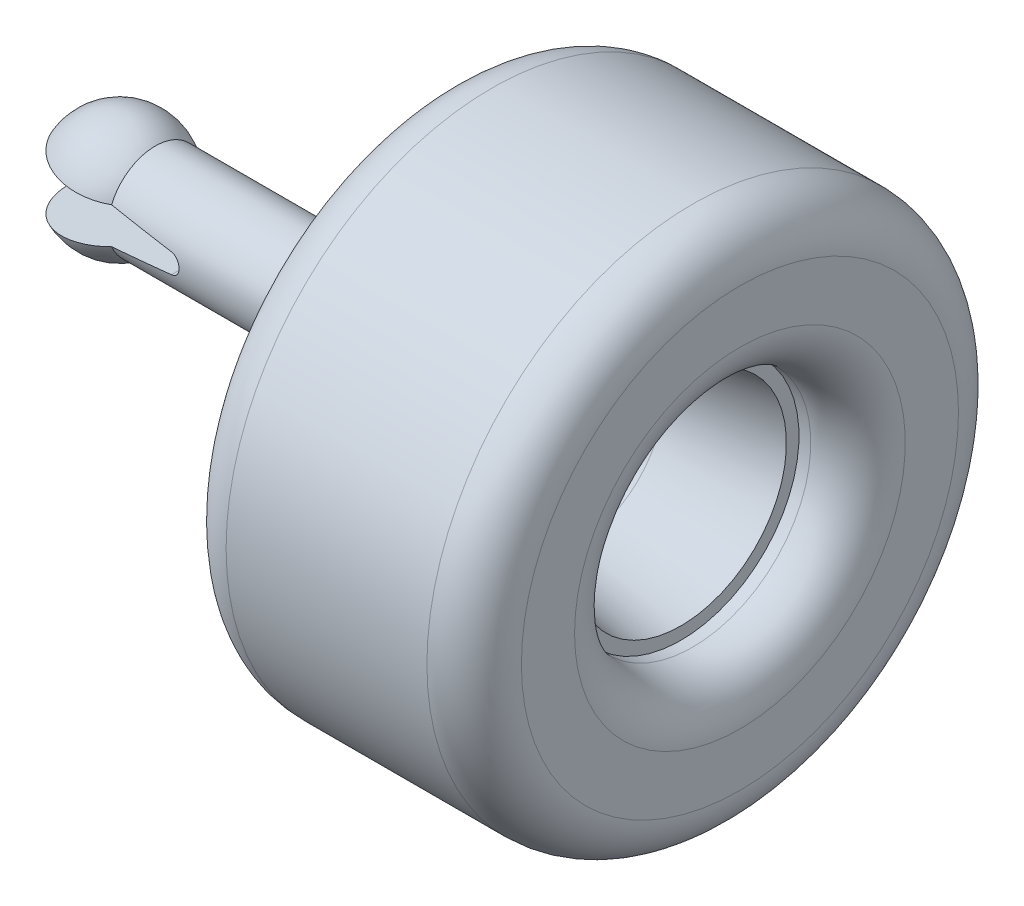
ISO-10303-21;
HEADER;
FILE_DESCRIPTION(('STEP AP214'),'2;1');
FILE_NAME('part.step','',(''),(''),'','','');
FILE_SCHEMA(('AUTOMOTIVE_DESIGN { 1 0 10303 214 1 1 1 1 }'));
ENDSEC;
DATA;
#1=APPLICATION_CONTEXT('core data for automotive mechanical design processes');
#2=APPLICATION_PROTOCOL_DEFINITION('international standard','automotive_design',2000,#1);
#3=PRODUCT_CONTEXT('',#1,'mechanical');
#4=PRODUCT('Part','Part','',(#3));
#5=PRODUCT_RELATED_PRODUCT_CATEGORY('part','',(#4));
#6=PRODUCT_DEFINITION_FORMATION('','',#4);
#7=PRODUCT_DEFINITION_CONTEXT('part definition',#1,'design');
#8=PRODUCT_DEFINITION('design','',#6,#7);
#9=PRODUCT_DEFINITION_SHAPE('','',#8);
#10=(LENGTH_UNIT() NAMED_UNIT(*) SI_UNIT(.MILLI.,.METRE.));
#11=(NAMED_UNIT(*) PLANE_ANGLE_UNIT() SI_UNIT($,.RADIAN.));
#12=(NAMED_UNIT(*) SI_UNIT($,.STERADIAN.) SOLID_ANGLE_UNIT());
#13=UNCERTAINTY_MEASURE_WITH_UNIT(LENGTH_MEASURE(1.E-05),#10,'distance_accuracy_value','');
#14=(GEOMETRIC_REPRESENTATION_CONTEXT(3) GLOBAL_UNCERTAINTY_ASSIGNED_CONTEXT((#13)) GLOBAL_UNIT_ASSIGNED_CONTEXT((#10,
#11,#12)) REPRESENTATION_CONTEXT('',''));
#15=CARTESIAN_POINT('',(0.,0.,0.));
#16=DIRECTION('',(0.,0.,1.));
#17=DIRECTION('',(1.,0.,0.));
#18=AXIS2_PLACEMENT_3D('',#15,#16,#17);
#19=CARTESIAN_POINT('',(0.,0.,0.));
#20=DIRECTION('',(-1.,0.,0.));
#21=DIRECTION('',(0.,1.,0.));
#22=AXIS2_PLACEMENT_3D('',#19,#20,#21);
#23=SPHERICAL_SURFACE('',#22,10.);
#24=CARTESIAN_POINT('',(0.499502112523149,3.7940952255126,0.));
#25=DIRECTION('',(-0.130526192220052,-0.99144486137381,0.));
#26=DIRECTION('',(0.99144486137381,-0.130526192220052,0.));
#27=AXIS2_PLACEMENT_3D('',#24,#25,#26);
#28=CIRCLE('',#27,9.23879532511287);
#29=CARTESIAN_POINT('',(6.,3.06994094065208,7.38752073573457));
#30=VERTEX_POINT('',#29);
#31=CARTESIAN_POINT('',(6.,3.06994094065208,-7.38752073573457));
#32=VERTEX_POINT('',#31);
#33=EDGE_CURVE('E82',#30,#32,#28,.T.);
#34=ORIENTED_EDGE('',*,*,#33,.F.);
#35=CARTESIAN_POINT('',(6.,0.,0.));
#36=DIRECTION('',(-1.,0.,0.));
#37=DIRECTION('',(0.,0.,1.));
#38=AXIS2_PLACEMENT_3D('',#35,#36,#37);
#39=CIRCLE('',#38,8.);
#40=EDGE_CURVE('E89',#30,#32,#39,.T.);
#41=ORIENTED_EDGE('',*,*,#40,.T.);
#42=EDGE_LOOP('',(#34,#41));
#43=FACE_BOUND('',#42,.T.);
#44=ADVANCED_FACE('F33',(#43),#23,.T.);
#45=CARTESIAN_POINT('',(0.499502112523149,-3.7940952255126,0.));
#46=DIRECTION('',(-0.130526192220052,0.99144486137381,0.));
#47=DIRECTION('',(-0.99144486137381,-0.130526192220052,0.));
#48=AXIS2_PLACEMENT_3D('',#45,#46,#47);
#49=CIRCLE('',#48,9.23879532511287);
#50=CARTESIAN_POINT('',(6.,-3.06994094065208,-7.38752073573457));
#51=VERTEX_POINT('',#50);
#52=CARTESIAN_POINT('',(6.,-3.06994094065208,7.38752073573457));
#53=VERTEX_POINT('',#52);
#54=EDGE_CURVE('E76',#51,#53,#49,.T.);
#55=ORIENTED_EDGE('',*,*,#54,.F.);
#56=EDGE_CURVE('E79',#51,#53,#39,.T.);
#57=ORIENTED_EDGE('',*,*,#56,.T.);
#58=EDGE_LOOP('',(#55,#57));
#59=FACE_BOUND('',#58,.T.);
#60=ADVANCED_FACE('F78',(#59),#23,.T.);
#61=CARTESIAN_POINT('',(0.,0.,0.));
#62=DIRECTION('',(-1.,0.,0.));
#63=DIRECTION('',(0.,0.,1.));
#64=AXIS2_PLACEMENT_3D('',#61,#62,#63);
#65=CYLINDRICAL_SURFACE('',#64,8.);
#66=CARTESIAN_POINT('',(49.,0.,0.));
#67=DIRECTION('',(-1.,0.,0.));
#68=DIRECTION('',(0.,0.,1.));
#69=AXIS2_PLACEMENT_3D('',#66,#67,#68);
#70=CIRCLE('',#69,8.);
#71=CARTESIAN_POINT('',(49.,0.,8.));
#72=VERTEX_POINT('',#71);
#73=EDGE_CURVE('E135',#72,#72,#70,.T.);
#74=ORIENTED_EDGE('',*,*,#73,.T.);
#75=EDGE_LOOP('',(#74));
#76=FACE_BOUND('',#75,.T.);
#77=CARTESIAN_POINT('',(29.3185165257813,0.,0.));
#78=DIRECTION('',(-0.130526192220052,-0.99144486137381,0.));
#79=DIRECTION('',(-0.99144486137381,0.130526192220052,0.));
#80=AXIS2_PLACEMENT_3D('',#77,#78,#79);
#81=ELLIPSE('',#80,61.290380604323,8.);
#82=CARTESIAN_POINT('',(16.5608664035253,1.67957650194115,7.8217020381837));
#83=VERTEX_POINT('',#82);
#84=EDGE_CURVE('E11',#83,#30,#81,.T.);
#85=ORIENTED_EDGE('',*,*,#84,.F.);
#86=CARTESIAN_POINT('',(16.5608664035253,-1.67957650194115,7.8217020381837));
#87=CARTESIAN_POINT('',(16.6078772170164,-1.67338762543842,7.82302855108955));
#88=CARTESIAN_POINT('',(16.6545923422185,-1.66522811009731,7.82477563599176));
#89=CARTESIAN_POINT('',(16.7471345142977,-1.64503813357798,7.82904617848296));
#90=CARTESIAN_POINT('',(16.7929617051527,-1.63300830563297,7.83156950906515));
#91=CARTESIAN_POINT('',(16.9284754014379,-1.59128070855494,7.84019399394773));
#92=CARTESIAN_POINT('',(17.0164191339467,-1.55591485482529,7.84735653429988));
#93=CARTESIAN_POINT('',(17.1849951770382,-1.47116924530017,7.86368295557066));
#94=CARTESIAN_POINT('',(17.2656278955788,-1.42179027207888,7.87284672472243));
#95=CARTESIAN_POINT('',(17.4175239261706,-1.31039436960253,7.89215143834716));
#96=CARTESIAN_POINT('',(17.4887859512125,-1.24837570733741,7.90229251671701));
#97=CARTESIAN_POINT('',(17.6209427467648,-1.11243703765622,7.92257916606893));
#98=CARTESIAN_POINT('',(17.6816821500275,-1.03836565464713,7.93272289609297));
#99=CARTESIAN_POINT('',(17.7898990682916,-0.880937155240475,7.9517436269811));
#100=CARTESIAN_POINT('',(17.8373756879766,-0.797579412489655,7.96062054230794));
#101=CARTESIAN_POINT('',(17.9176296745451,-0.623934920890098,7.9761073846185));
#102=CARTESIAN_POINT('',(17.9504178222908,-0.533653311126496,7.98271897343746));
#103=CARTESIAN_POINT('',(18.0003036625157,-0.348697563255279,7.9929330301457));
#104=CARTESIAN_POINT('',(18.0174041378688,-0.254024207341631,7.99653603172528));
#105=CARTESIAN_POINT('',(18.0351812898347,-0.0649264046473598,8.00028471028731));
#106=CARTESIAN_POINT('',(18.0361681921212,0.0294676640748496,8.00049569074478));
#107=CARTESIAN_POINT('',(18.0224820490252,0.217058139199833,7.99760497865984));
#108=CARTESIAN_POINT('',(18.0078096358643,0.31025459380076,7.99450341985627));
#109=CARTESIAN_POINT('',(17.9634572208263,0.49205720501012,7.98536817502689));
#110=CARTESIAN_POINT('',(17.9338973614567,0.580693944827233,7.97935797682421));
#111=CARTESIAN_POINT('',(17.8607254169284,0.75176455890913,7.96506281352426));
#112=CARTESIAN_POINT('',(17.8171121127074,0.83419789429573,7.95677765109503));
#113=CARTESIAN_POINT('',(17.7163043503394,0.991891543038238,7.93867449799588));
#114=CARTESIAN_POINT('',(17.6589139074844,1.06702407507846,7.92883516146981));
#115=CARTESIAN_POINT('',(17.5324746052698,1.20670885364806,7.90878266995101));
#116=CARTESIAN_POINT('',(17.4634230384255,1.27125863619489,7.8985694285772));
#117=CARTESIAN_POINT('',(17.3143007976698,1.38898781207942,7.87872723601544));
#118=CARTESIAN_POINT('',(17.2340698925972,1.44196630448345,7.86911041438953));
#119=CARTESIAN_POINT('',(17.0656806435511,1.5336425345316,7.85175953658975));
#120=CARTESIAN_POINT('',(16.9775295819394,1.57235322722257,7.84402377461176));
#121=CARTESIAN_POINT('',(16.8338504437119,1.62137648926141,7.83399484923287));
#122=CARTESIAN_POINT('',(16.7800760782905,1.63679694146785,7.83077800436232));
#123=CARTESIAN_POINT('',(16.6712916163422,1.66224742004713,7.82541266745395));
#124=CARTESIAN_POINT('',(16.6162832801273,1.67228467242321,7.82326274355275));
#125=CARTESIAN_POINT('',(16.5608664035253,1.67957650194115,7.8217020381837));
#126=B_SPLINE_CURVE_WITH_KNOTS('',3,(#86,#87,#88,#89,#90,#91,#92,#93,#94,#95,#96,#97,#98,#99,
#100,#101,#102,#103,#104,#105,#106,#107,#108,#109,#110,#111,#112,#113,#114,#115,#116,#117,#118,
#119,#120,#121,#122,#123,#124,#125),.UNSPECIFIED.,.F.,.F.,(4,2,2,2,2,2,2,2,2,2,2,2,2,2,2,2,2,2,
2,4),(0.,0.142214203486567,0.284405150711697,0.568114307916015,0.851807624266233,
1.13553986360921,1.42315832931077,1.71079620627369,1.9982226190729,2.28559803474745,
2.56743410302325,2.84925879301757,3.12884473630301,3.40845493872973,3.69230672036942,
3.97622449767661,4.26473668466631,4.55298625576828,4.72083168810947,4.88845124984131),.UNSPECIFIED.);
#127=CARTESIAN_POINT('',(16.5608664035253,-1.67957650194115,7.82170203818378));
#128=VERTEX_POINT('',#127);
#129=EDGE_CURVE('E36',#128,#83,#126,.T.);
#130=ORIENTED_EDGE('',*,*,#129,.F.);
#131=CARTESIAN_POINT('',(29.3185165257813,0.,0.));
#132=DIRECTION('',(-0.130526192220052,0.99144486137381,0.));
#133=DIRECTION('',(-0.99144486137381,-0.130526192220052,0.));
#134=AXIS2_PLACEMENT_3D('',#131,#132,#133);
#135=ELLIPSE('',#134,61.290380604323,8.);
#136=EDGE_CURVE('E88',#53,#128,#135,.T.);
#137=ORIENTED_EDGE('',*,*,#136,.F.);
#138=ORIENTED_EDGE('',*,*,#56,.F.);
#139=CARTESIAN_POINT('',(16.5608664035253,-1.67957650194115,-7.82170203818364));
#140=VERTEX_POINT('',#139);
#141=EDGE_CURVE('E86',#140,#51,#135,.T.);
#142=ORIENTED_EDGE('',*,*,#141,.F.);
#143=CARTESIAN_POINT('',(16.5608664035253,1.67957650194115,-7.8217020381837));
#144=CARTESIAN_POINT('',(16.6078772170164,1.67338762543842,-7.82302855108955));
#145=CARTESIAN_POINT('',(16.6545923422185,1.66522811009731,-7.82477563599176));
#146=CARTESIAN_POINT('',(16.7471345142977,1.64503813357798,-7.82904617848296));
#147=CARTESIAN_POINT('',(16.7929617051527,1.63300830563297,-7.83156950906515));
#148=CARTESIAN_POINT('',(16.9284754014379,1.59128070855494,-7.84019399394773));
#149=CARTESIAN_POINT('',(17.0164191339467,1.55591485482529,-7.84735653429988));
#150=CARTESIAN_POINT('',(17.1849951770382,1.47116924530017,-7.86368295557066));
#151=CARTESIAN_POINT('',(17.2656278955788,1.42179027207888,-7.87284672472243));
#152=CARTESIAN_POINT('',(17.4175239261706,1.31039436960253,-7.89215143834716));
#153=CARTESIAN_POINT('',(17.4887859512125,1.24837570733741,-7.90229251671701));
#154=CARTESIAN_POINT('',(17.6209427467648,1.11243703765622,-7.92257916606893));
#155=CARTESIAN_POINT('',(17.6816821500275,1.03836565464713,-7.93272289609297));
#156=CARTESIAN_POINT('',(17.7898990682916,0.880937155240475,-7.9517436269811));
#157=CARTESIAN_POINT('',(17.8373756879766,0.797579412489655,-7.96062054230794));
#158=CARTESIAN_POINT('',(17.9176296745451,0.623934920890098,-7.9761073846185));
#159=CARTESIAN_POINT('',(17.9504178222908,0.533653311126496,-7.98271897343746));
#160=CARTESIAN_POINT('',(18.0003036625157,0.348697563255279,-7.9929330301457));
#161=CARTESIAN_POINT('',(18.0174041378688,0.254024207341631,-7.99653603172528));
#162=CARTESIAN_POINT('',(18.0351812898347,0.0649264046473598,-8.00028471028731));
#163=CARTESIAN_POINT('',(18.0361681921212,-0.0294676640748496,-8.00049569074478));
#164=CARTESIAN_POINT('',(18.0224820490252,-0.217058139199833,-7.99760497865984));
#165=CARTESIAN_POINT('',(18.0078096358643,-0.31025459380076,-7.99450341985627));
#166=CARTESIAN_POINT('',(17.9634572208263,-0.49205720501012,-7.98536817502689));
#167=CARTESIAN_POINT('',(17.9338973614567,-0.580693944827233,-7.97935797682421));
#168=CARTESIAN_POINT('',(17.8607254169284,-0.75176455890913,-7.96506281352426));
#169=CARTESIAN_POINT('',(17.8171121127074,-0.83419789429573,-7.95677765109503));
#170=CARTESIAN_POINT('',(17.7163043503394,-0.991891543038238,-7.93867449799588));
#171=CARTESIAN_POINT('',(17.6589139074844,-1.06702407507846,-7.92883516146981));
#172=CARTESIAN_POINT('',(17.5324746052698,-1.20670885364806,-7.90878266995101));
#173=CARTESIAN_POINT('',(17.4634230384255,-1.27125863619489,-7.8985694285772));
#174=CARTESIAN_POINT('',(17.3143007976698,-1.38898781207942,-7.87872723601544));
#175=CARTESIAN_POINT('',(17.2340698925972,-1.44196630448345,-7.86911041438953));
#176=CARTESIAN_POINT('',(17.0656806435511,-1.5336425345316,-7.85175953658975));
#177=CARTESIAN_POINT('',(16.9775295819394,-1.57235322722257,-7.84402377461176));
#178=CARTESIAN_POINT('',(16.8338504437119,-1.62137648926141,-7.83399484923287));
#179=CARTESIAN_POINT('',(16.7800760782905,-1.63679694146785,-7.83077800436232));
#180=CARTESIAN_POINT('',(16.6712916163422,-1.66224742004713,-7.82541266745395));
#181=CARTESIAN_POINT('',(16.6162832801273,-1.67228467242321,-7.82326274355275));
#182=CARTESIAN_POINT('',(16.5608664035253,-1.67957650194115,-7.8217020381837));
#183=B_SPLINE_CURVE_WITH_KNOTS('',3,(#143,#144,#145,#146,#147,#148,#149,#150,#151,#152,#153,
#154,#155,#156,#157,#158,#159,#160,#161,#162,#163,#164,#165,#166,#167,#168,#169,#170,#171,#172,
#173,#174,#175,#176,#177,#178,#179,#180,#181,#182),.UNSPECIFIED.,.F.,.F.,(4,2,2,2,2,2,2,2,2,2,2,
2,2,2,2,2,2,2,2,4),(0.,0.142214203486567,0.284405150711697,0.568114307916015,0.851807624266233,
1.13553986360921,1.42315832931077,1.71079620627369,1.9982226190729,2.28559803474745,
2.56743410302325,2.84925879301757,3.12884473630301,3.40845493872973,3.69230672036942,
3.97622449767661,4.26473668466631,4.55298625576828,4.72083168810947,4.88845124984131),.UNSPECIFIED.);
#184=CARTESIAN_POINT('',(16.5608664035253,1.67957650194115,-7.8217020381837));
#185=VERTEX_POINT('',#184);
#186=EDGE_CURVE('E95',#185,#140,#183,.T.);
#187=ORIENTED_EDGE('',*,*,#186,.F.);
#188=EDGE_CURVE('E47',#32,#185,#81,.T.);
#189=ORIENTED_EDGE('',*,*,#188,.F.);
#190=ORIENTED_EDGE('',*,*,#40,.F.);
#191=EDGE_LOOP('',(#85,#130,#137,#138,#142,#187,#189,#190));
#192=FACE_BOUND('',#191,.T.);
#193=ADVANCED_FACE('F85',(#76,#192),#65,.T.);
#194=CARTESIAN_POINT('',(75.,5.,0.));
#195=DIRECTION('',(-1.,0.,0.));
#196=DIRECTION('',(0.,0.,1.));
#197=AXIS2_PLACEMENT_3D('',#194,#195,#196);
#198=PLANE('',#197);
#199=CARTESIAN_POINT('',(75.,0.,0.));
#200=DIRECTION('',(-1.,0.,0.));
#201=DIRECTION('',(0.,0.,1.));
#202=AXIS2_PLACEMENT_3D('',#199,#200,#201);
#203=CIRCLE('',#202,5.);
#204=CARTESIAN_POINT('',(75.,0.,5.));
#205=VERTEX_POINT('',#204);
#206=EDGE_CURVE('E96',#205,#205,#203,.T.);
#207=ORIENTED_EDGE('',*,*,#206,.F.);
#208=EDGE_LOOP('',(#207));
#209=FACE_BOUND('',#208,.T.);
#210=ADVANCED_FACE('F179',(#209),#198,.F.);
#211=CARTESIAN_POINT('',(75.,0.,0.));
#212=DIRECTION('',(-1.,0.,0.));
#213=DIRECTION('',(0.,0.,1.));
#214=AXIS2_PLACEMENT_3D('',#211,#212,#213);
#215=CONICAL_SURFACE('',#214,5.,0.0872664625997168);
#216=CARTESIAN_POINT('',(66.1557394314195,0.,0.));
#217=DIRECTION('',(-1.,0.,0.));
#218=DIRECTION('',(0.,0.,1.));
#219=AXIS2_PLACEMENT_3D('',#216,#217,#218);
#220=CIRCLE('',#219,5.77377253702014);
#221=CARTESIAN_POINT('',(66.1557394314195,0.,5.77377253702014));
#222=VERTEX_POINT('',#221);
#223=EDGE_CURVE('E100',#222,#222,#220,.T.);
#224=ORIENTED_EDGE('',*,*,#223,.F.);
#225=EDGE_LOOP('',(#224));
#226=FACE_BOUND('',#225,.T.);
#227=ORIENTED_EDGE('',*,*,#206,.T.);
#228=EDGE_LOOP('',(#227));
#229=FACE_BOUND('',#228,.T.);
#230=ADVANCED_FACE('F176',(#226,#229),#215,.T.);
#231=CARTESIAN_POINT('',(80.,0.,0.));
#232=DIRECTION('',(-1.,0.,0.));
#233=DIRECTION('',(0.,1.,0.));
#234=AXIS2_PLACEMENT_3D('',#231,#232,#233);
#235=SPHERICAL_SURFACE('',#234,15.);
#236=CARTESIAN_POINT('',(77.395277334996,0.,0.));
#237=DIRECTION('',(-1.,0.,0.));
#238=DIRECTION('',(0.,0.,1.));
#239=AXIS2_PLACEMENT_3D('',#236,#237,#238);
#240=CIRCLE('',#239,14.7721162951831);
#241=CARTESIAN_POINT('',(77.395277334996,0.,14.7721162951831));
#242=VERTEX_POINT('',#241);
#243=EDGE_CURVE('E168',#242,#242,#240,.T.);
#244=ORIENTED_EDGE('',*,*,#243,.F.);
#245=EDGE_LOOP('',(#244));
#246=FACE_BOUND('',#245,.T.);
#247=ORIENTED_EDGE('',*,*,#223,.T.);
#248=EDGE_LOOP('',(#247));
#249=FACE_BOUND('',#248,.T.);
#250=ADVANCED_FACE('F174',(#246,#249),#235,.F.);
#251=CARTESIAN_POINT('',(77.395277334996,0.,0.));
#252=DIRECTION('',(1.,0.,0.));
#253=DIRECTION('',(0.,0.,-1.));
#254=AXIS2_PLACEMENT_3D('',#251,#252,#253);
#255=CONICAL_SURFACE('',#254,14.7721162951831,0.174532925199434);
#256=CARTESIAN_POINT('',(95.,0.,0.));
#257=DIRECTION('',(-1.,0.,0.));
#258=DIRECTION('',(0.,0.,1.));
#259=AXIS2_PLACEMENT_3D('',#256,#257,#258);
#260=CIRCLE('',#259,17.8763038889132);
#261=CARTESIAN_POINT('',(95.,0.,17.8763038889132));
#262=VERTEX_POINT('',#261);
#263=EDGE_CURVE('E165',#262,#262,#260,.T.);
#264=ORIENTED_EDGE('',*,*,#263,.F.);
#265=EDGE_LOOP('',(#264));
#266=FACE_BOUND('',#265,.T.);
#267=ORIENTED_EDGE('',*,*,#243,.T.);
#268=EDGE_LOOP('',(#267));
#269=FACE_BOUND('',#268,.T.);
#270=ADVANCED_FACE('F191',(#266,#269),#255,.F.);
#271=CARTESIAN_POINT('',(95.,20.,0.));
#272=DIRECTION('',(-1.,0.,0.));
#273=DIRECTION('',(0.,0.,1.));
#274=AXIS2_PLACEMENT_3D('',#271,#272,#273);
#275=PLANE('',#274);
#276=CARTESIAN_POINT('',(95.,0.,0.));
#277=DIRECTION('',(-1.,0.,0.));
#278=DIRECTION('',(0.,0.,1.));
#279=AXIS2_PLACEMENT_3D('',#276,#277,#278);
#280=CIRCLE('',#279,20.);
#281=CARTESIAN_POINT('',(95.,0.,20.));
#282=VERTEX_POINT('',#281);
#283=EDGE_CURVE('E162',#282,#282,#280,.T.);
#284=ORIENTED_EDGE('',*,*,#283,.F.);
#285=EDGE_LOOP('',(#284));
#286=FACE_BOUND('',#285,.T.);
#287=ORIENTED_EDGE('',*,*,#263,.T.);
#288=EDGE_LOOP('',(#287));
#289=FACE_BOUND('',#288,.T.);
#290=ADVANCED_FACE('F195',(#286,#289),#275,.F.);
#291=CARTESIAN_POINT('',(0.,0.,0.));
#292=DIRECTION('',(-1.,0.,0.));
#293=DIRECTION('',(0.,0.,1.));
#294=AXIS2_PLACEMENT_3D('',#291,#292,#293);
#295=CYLINDRICAL_SURFACE('',#294,20.);
#296=CARTESIAN_POINT('',(97.,0.,0.));
#297=DIRECTION('',(-1.,0.,0.));
#298=DIRECTION('',(0.,0.,1.));
#299=AXIS2_PLACEMENT_3D('',#296,#297,#298);
#300=CIRCLE('',#299,20.);
#301=CARTESIAN_POINT('',(97.,0.,20.));
#302=VERTEX_POINT('',#301);
#303=EDGE_CURVE('E159',#302,#302,#300,.T.);
#304=ORIENTED_EDGE('',*,*,#303,.F.);
#305=EDGE_LOOP('',(#304));
#306=FACE_BOUND('',#305,.T.);
#307=ORIENTED_EDGE('',*,*,#283,.T.);
#308=EDGE_LOOP('',(#307));
#309=FACE_BOUND('',#308,.T.);
#310=ADVANCED_FACE('F199',(#306,#309),#295,.F.);
#311=CARTESIAN_POINT('',(97.,0.,0.));
#312=DIRECTION('',(-1.,0.,0.));
#313=DIRECTION('',(0.,0.,1.));
#314=AXIS2_PLACEMENT_3D('',#311,#312,#313);
#315=TOROIDAL_SURFACE('',#314,28.,7.99999999999999);
#316=CARTESIAN_POINT('',(105.,0.,0.));
#317=DIRECTION('',(-1.,0.,0.));
#318=DIRECTION('',(0.,0.,1.));
#319=AXIS2_PLACEMENT_3D('',#316,#317,#318);
#320=CIRCLE('',#319,28.);
#321=CARTESIAN_POINT('',(105.,0.,28.));
#322=VERTEX_POINT('',#321);
#323=EDGE_CURVE('E156',#322,#322,#320,.T.);
#324=ORIENTED_EDGE('',*,*,#323,.F.);
#325=EDGE_LOOP('',(#324));
#326=FACE_BOUND('',#325,.T.);
#327=ORIENTED_EDGE('',*,*,#303,.T.);
#328=EDGE_LOOP('',(#327));
#329=FACE_BOUND('',#328,.T.);
#330=ADVANCED_FACE('F203',(#326,#329),#315,.T.);
#331=CARTESIAN_POINT('',(105.,37.,0.));
#332=DIRECTION('',(-1.,0.,0.));
#333=DIRECTION('',(0.,0.,1.));
#334=AXIS2_PLACEMENT_3D('',#331,#332,#333);
#335=PLANE('',#334);
#336=CARTESIAN_POINT('',(105.,0.,0.));
#337=DIRECTION('',(-1.,0.,0.));
#338=DIRECTION('',(0.,0.,1.));
#339=AXIS2_PLACEMENT_3D('',#336,#337,#338);
#340=CIRCLE('',#339,37.);
#341=CARTESIAN_POINT('',(105.,0.,37.));
#342=VERTEX_POINT('',#341);
#343=EDGE_CURVE('E153',#342,#342,#340,.T.);
#344=ORIENTED_EDGE('',*,*,#343,.F.);
#345=EDGE_LOOP('',(#344));
#346=FACE_BOUND('',#345,.T.);
#347=ORIENTED_EDGE('',*,*,#323,.T.);
#348=EDGE_LOOP('',(#347));
#349=FACE_BOUND('',#348,.T.);
#350=ADVANCED_FACE('F207',(#346,#349),#335,.F.);
#351=CARTESIAN_POINT('',(97.,0.,0.));
#352=DIRECTION('',(-1.,0.,0.));
#353=DIRECTION('',(0.,0.,1.));
#354=AXIS2_PLACEMENT_3D('',#351,#352,#353);
#355=TOROIDAL_SURFACE('',#354,37.,7.99999999999999);
#356=CARTESIAN_POINT('',(97.,0.,0.));
#357=DIRECTION('',(-1.,0.,0.));
#358=DIRECTION('',(0.,0.,1.));
#359=AXIS2_PLACEMENT_3D('',#356,#357,#358);
#360=CIRCLE('',#359,45.);
#361=CARTESIAN_POINT('',(97.,0.,45.));
#362=VERTEX_POINT('',#361);
#363=EDGE_CURVE('E150',#362,#362,#360,.T.);
#364=ORIENTED_EDGE('',*,*,#363,.F.);
#365=EDGE_LOOP('',(#364));
#366=FACE_BOUND('',#365,.T.);
#367=ORIENTED_EDGE('',*,*,#343,.T.);
#368=EDGE_LOOP('',(#367));
#369=FACE_BOUND('',#368,.T.);
#370=ADVANCED_FACE('F211',(#366,#369),#355,.T.);
#371=CARTESIAN_POINT('',(0.,0.,0.));
#372=DIRECTION('',(-1.,0.,0.));
#373=DIRECTION('',(0.,0.,1.));
#374=AXIS2_PLACEMENT_3D('',#371,#372,#373);
#375=CYLINDRICAL_SURFACE('',#374,45.);
#376=CARTESIAN_POINT('',(63.,0.,0.));
#377=DIRECTION('',(-1.,0.,0.));
#378=DIRECTION('',(0.,0.,1.));
#379=AXIS2_PLACEMENT_3D('',#376,#377,#378);
#380=CIRCLE('',#379,45.);
#381=CARTESIAN_POINT('',(63.,0.,45.));
#382=VERTEX_POINT('',#381);
#383=EDGE_CURVE('E147',#382,#382,#380,.T.);
#384=ORIENTED_EDGE('',*,*,#383,.F.);
#385=EDGE_LOOP('',(#384));
#386=FACE_BOUND('',#385,.T.);
#387=ORIENTED_EDGE('',*,*,#363,.T.);
#388=EDGE_LOOP('',(#387));
#389=FACE_BOUND('',#388,.T.);
#390=ADVANCED_FACE('F215',(#386,#389),#375,.T.);
#391=CARTESIAN_POINT('',(63.,0.,0.));
#392=DIRECTION('',(-1.,0.,0.));
#393=DIRECTION('',(0.,0.,1.));
#394=AXIS2_PLACEMENT_3D('',#391,#392,#393);
#395=TOROIDAL_SURFACE('',#394,37.,8.);
#396=CARTESIAN_POINT('',(55.,0.,0.));
#397=DIRECTION('',(-1.,0.,0.));
#398=DIRECTION('',(0.,0.,1.));
#399=AXIS2_PLACEMENT_3D('',#396,#397,#398);
#400=CIRCLE('',#399,37.);
#401=CARTESIAN_POINT('',(55.,0.,37.));
#402=VERTEX_POINT('',#401);
#403=EDGE_CURVE('E144',#402,#402,#400,.T.);
#404=ORIENTED_EDGE('',*,*,#403,.F.);
#405=EDGE_LOOP('',(#404));
#406=FACE_BOUND('',#405,.T.);
#407=ORIENTED_EDGE('',*,*,#383,.T.);
#408=EDGE_LOOP('',(#407));
#409=FACE_BOUND('',#408,.T.);
#410=ADVANCED_FACE('F219',(#406,#409),#395,.T.);
#411=CARTESIAN_POINT('',(55.,14.,0.));
#412=DIRECTION('',(1.,0.,0.));
#413=DIRECTION('',(0.,0.,-1.));
#414=AXIS2_PLACEMENT_3D('',#411,#412,#413);
#415=PLANE('',#414);
#416=CARTESIAN_POINT('',(55.,0.,0.));
#417=DIRECTION('',(-1.,0.,0.));
#418=DIRECTION('',(0.,0.,1.));
#419=AXIS2_PLACEMENT_3D('',#416,#417,#418);
#420=CIRCLE('',#419,14.);
#421=CARTESIAN_POINT('',(55.,0.,14.));
#422=VERTEX_POINT('',#421);
#423=EDGE_CURVE('E141',#422,#422,#420,.T.);
#424=ORIENTED_EDGE('',*,*,#423,.F.);
#425=EDGE_LOOP('',(#424));
#426=FACE_BOUND('',#425,.T.);
#427=ORIENTED_EDGE('',*,*,#403,.T.);
#428=EDGE_LOOP('',(#427));
#429=FACE_BOUND('',#428,.T.);
#430=ADVANCED_FACE('F126',(#426,#429),#415,.F.);
#431=CARTESIAN_POINT('',(49.,0.,0.));
#432=DIRECTION('',(-1.,0.,0.));
#433=DIRECTION('',(0.,0.,1.));
#434=AXIS2_PLACEMENT_3D('',#431,#432,#433);
#435=TOROIDAL_SURFACE('',#434,14.,6.);
#436=ORIENTED_EDGE('',*,*,#73,.F.);
#437=EDGE_LOOP('',(#436));
#438=FACE_BOUND('',#437,.T.);
#439=ORIENTED_EDGE('',*,*,#423,.T.);
#440=EDGE_LOOP('',(#439));
#441=FACE_BOUND('',#440,.T.);
#442=ADVANCED_FACE('F122',(#438,#441),#435,.F.);
#443=CARTESIAN_POINT('',(-8.66025403784439,5.,224.421459980106));
#444=DIRECTION('',(-0.130526192220052,-0.99144486137381,0.));
#445=DIRECTION('',(0.99144486137381,-0.130526192220052,0.));
#446=AXIS2_PLACEMENT_3D('',#443,#444,#445);
#447=PLANE('',#446);
#448=ORIENTED_EDGE('',*,*,#33,.T.);
#449=ORIENTED_EDGE('',*,*,#188,.T.);
#450=DIRECTION('',(0.,0.,-1.));
#451=VECTOR('',#450,1.);
#452=CARTESIAN_POINT('',(16.5608664035253,1.67957650194115,224.421459980106));
#453=LINE('',#452,#451);
#454=EDGE_CURVE('E83',#83,#185,#453,.T.);
#455=ORIENTED_EDGE('',*,*,#454,.F.);
#456=ORIENTED_EDGE('',*,*,#84,.T.);
#457=EDGE_LOOP('',(#448,#449,#455,#456));
#458=FACE_BOUND('',#457,.T.);
#459=ADVANCED_FACE('F118',(#458),#447,.T.);
#460=CARTESIAN_POINT('',(16.3397459621556,0.,224.421459980106));
#461=DIRECTION('',(0.,0.,-1.));
#462=DIRECTION('',(-1.,0.,0.));
#463=AXIS2_PLACEMENT_3D('',#460,#461,#462);
#464=CYLINDRICAL_SURFACE('',#463,1.69406950136775);
#465=DIRECTION('',(0.,0.,-1.));
#466=VECTOR('',#465,1.);
#467=CARTESIAN_POINT('',(16.5608664035253,-1.67957650194115,224.421459980106));
#468=LINE('',#467,#466);
#469=EDGE_CURVE('E94',#128,#140,#468,.T.);
#470=ORIENTED_EDGE('',*,*,#469,.F.);
#471=ORIENTED_EDGE('',*,*,#129,.T.);
#472=ORIENTED_EDGE('',*,*,#454,.T.);
#473=ORIENTED_EDGE('',*,*,#186,.T.);
#474=EDGE_LOOP('',(#470,#471,#472,#473));
#475=FACE_BOUND('',#474,.T.);
#476=ADVANCED_FACE('F114',(#475),#464,.F.);
#477=CARTESIAN_POINT('',(-8.66025403784439,-5.,224.421459980106));
#478=DIRECTION('',(-0.130526192220052,0.99144486137381,0.));
#479=DIRECTION('',(-0.99144486137381,-0.130526192220052,0.));
#480=AXIS2_PLACEMENT_3D('',#477,#478,#479);
#481=PLANE('',#480);
#482=ORIENTED_EDGE('',*,*,#54,.T.);
#483=ORIENTED_EDGE('',*,*,#136,.T.);
#484=ORIENTED_EDGE('',*,*,#469,.T.);
#485=ORIENTED_EDGE('',*,*,#141,.T.);
#486=EDGE_LOOP('',(#482,#483,#484,#485));
#487=FACE_BOUND('',#486,.T.);
#488=ADVANCED_FACE('F92',(#487),#481,.T.);
#489=CLOSED_SHELL('',(#44,#60,#193,#210,#230,#250,#270,#290,#310,#330,#350,#370,#390,#410,#430,
#442,#459,#476,#488));
#490=MANIFOLD_SOLID_BREP('B2',#489);
#491=ADVANCED_BREP_SHAPE_REPRESENTATION('',(#18,#490),#14);
#492=SHAPE_DEFINITION_REPRESENTATION(#9,#491);
ENDSEC;
END-ISO-10303-21;
